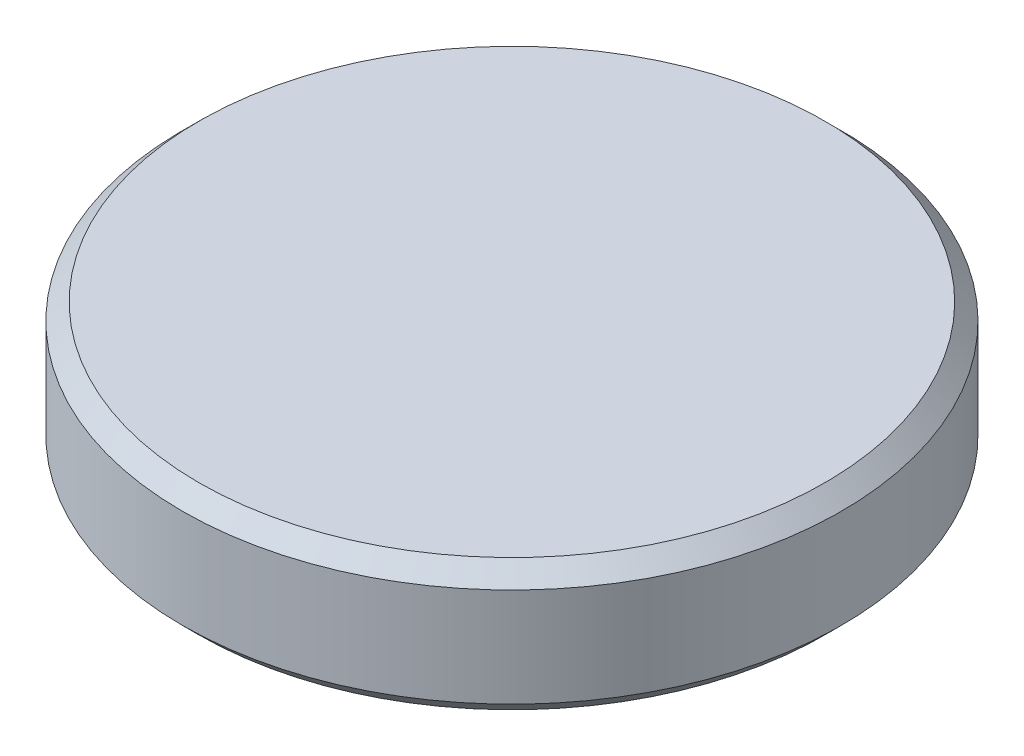
ISO-10303-21;
HEADER;
FILE_DESCRIPTION(('STEP AP214'),'2;1');
FILE_NAME('part.step','',(''),(''),'','','');
FILE_SCHEMA(('AUTOMOTIVE_DESIGN { 1 0 10303 214 1 1 1 1 }'));
ENDSEC;
DATA;
#1=APPLICATION_CONTEXT('core data for automotive mechanical design processes');
#2=APPLICATION_PROTOCOL_DEFINITION('international standard','automotive_design',2000,#1);
#3=PRODUCT_CONTEXT('',#1,'mechanical');
#4=PRODUCT('Part','Part','',(#3));
#5=PRODUCT_RELATED_PRODUCT_CATEGORY('part','',(#4));
#6=PRODUCT_DEFINITION_FORMATION('','',#4);
#7=PRODUCT_DEFINITION_CONTEXT('part definition',#1,'design');
#8=PRODUCT_DEFINITION('design','',#6,#7);
#9=PRODUCT_DEFINITION_SHAPE('','',#8);
#10=(LENGTH_UNIT() NAMED_UNIT(*) SI_UNIT(.MILLI.,.METRE.));
#11=(NAMED_UNIT(*) PLANE_ANGLE_UNIT() SI_UNIT($,.RADIAN.));
#12=(NAMED_UNIT(*) SI_UNIT($,.STERADIAN.) SOLID_ANGLE_UNIT());
#13=UNCERTAINTY_MEASURE_WITH_UNIT(LENGTH_MEASURE(1.E-05),#10,'distance_accuracy_value','');
#14=(GEOMETRIC_REPRESENTATION_CONTEXT(3) GLOBAL_UNCERTAINTY_ASSIGNED_CONTEXT((#13)) GLOBAL_UNIT_ASSIGNED_CONTEXT((#10,
#11,#12)) REPRESENTATION_CONTEXT('',''));
#15=CARTESIAN_POINT('',(0.,0.,0.));
#16=DIRECTION('',(0.,0.,1.));
#17=DIRECTION('',(1.,0.,0.));
#18=AXIS2_PLACEMENT_3D('',#15,#16,#17);
#19=CARTESIAN_POINT('',(0.,2.,0.));
#20=DIRECTION('',(0.,-1.,0.));
#21=DIRECTION('',(0.,0.,-1.));
#22=AXIS2_PLACEMENT_3D('',#19,#20,#21);
#23=CYLINDRICAL_SURFACE('',#22,5.);
#24=CARTESIAN_POINT('',(0.,0.250000000000002,0.));
#25=DIRECTION('',(0.,1.,0.));
#26=DIRECTION('',(0.,0.,1.));
#27=AXIS2_PLACEMENT_3D('',#24,#25,#26);
#28=CIRCLE('',#27,5.);
#29=CARTESIAN_POINT('',(0.,0.250000000000002,5.));
#30=VERTEX_POINT('',#29);
#31=EDGE_CURVE('E42',#30,#30,#28,.T.);
#32=ORIENTED_EDGE('',*,*,#31,.T.);
#33=EDGE_LOOP('',(#32));
#34=FACE_BOUND('',#33,.T.);
#35=CARTESIAN_POINT('',(0.,1.75,0.));
#36=DIRECTION('',(0.,1.,0.));
#37=DIRECTION('',(0.,0.,1.));
#38=AXIS2_PLACEMENT_3D('',#35,#36,#37);
#39=CIRCLE('',#38,5.);
#40=CARTESIAN_POINT('',(0.,1.75,5.));
#41=VERTEX_POINT('',#40);
#42=EDGE_CURVE('E46',#41,#41,#39,.F.);
#43=ORIENTED_EDGE('',*,*,#42,.T.);
#44=EDGE_LOOP('',(#43));
#45=FACE_BOUND('',#44,.T.);
#46=ADVANCED_FACE('F31',(#34,#45),#23,.T.);
#47=CARTESIAN_POINT('',(0.,2.,0.));
#48=DIRECTION('',(0.,1.,0.));
#49=DIRECTION('',(0.,0.,1.));
#50=AXIS2_PLACEMENT_3D('',#47,#48,#49);
#51=PLANE('',#50);
#52=CARTESIAN_POINT('',(0.,2.,0.));
#53=DIRECTION('',(0.,1.,0.));
#54=DIRECTION('',(0.,0.,1.));
#55=AXIS2_PLACEMENT_3D('',#52,#53,#54);
#56=CIRCLE('',#55,4.75);
#57=CARTESIAN_POINT('',(0.,2.,4.75));
#58=VERTEX_POINT('',#57);
#59=EDGE_CURVE('E10',#58,#58,#56,.T.);
#60=ORIENTED_EDGE('',*,*,#59,.T.);
#61=EDGE_LOOP('',(#60));
#62=FACE_BOUND('',#61,.T.);
#63=ADVANCED_FACE('F62',(#62),#51,.T.);
#64=CARTESIAN_POINT('',(0.,0.,0.));
#65=DIRECTION('',(0.,1.,0.));
#66=DIRECTION('',(0.,0.,1.));
#67=AXIS2_PLACEMENT_3D('',#64,#65,#66);
#68=PLANE('',#67);
#69=CARTESIAN_POINT('',(0.,0.,0.));
#70=DIRECTION('',(0.,1.,0.));
#71=DIRECTION('',(0.,0.,1.));
#72=AXIS2_PLACEMENT_3D('',#69,#70,#71);
#73=CIRCLE('',#72,4.75);
#74=CARTESIAN_POINT('',(0.,0.,4.75));
#75=VERTEX_POINT('',#74);
#76=EDGE_CURVE('E38',#75,#75,#73,.F.);
#77=ORIENTED_EDGE('',*,*,#76,.T.);
#78=EDGE_LOOP('',(#77));
#79=FACE_BOUND('',#78,.T.);
#80=ADVANCED_FACE('F59',(#79),#68,.F.);
#81=CARTESIAN_POINT('',(0.,0.250000000000002,0.));
#82=DIRECTION('',(0.,1.,0.));
#83=DIRECTION('',(0.,0.,1.));
#84=AXIS2_PLACEMENT_3D('',#81,#82,#83);
#85=CONICAL_SURFACE('',#84,5.,0.785398163397452);
#86=ORIENTED_EDGE('',*,*,#76,.F.);
#87=EDGE_LOOP('',(#86));
#88=FACE_BOUND('',#87,.T.);
#89=ORIENTED_EDGE('',*,*,#31,.F.);
#90=EDGE_LOOP('',(#89));
#91=FACE_BOUND('',#90,.T.);
#92=ADVANCED_FACE('F55',(#88,#91),#85,.T.);
#93=CARTESIAN_POINT('',(0.,2.,0.));
#94=DIRECTION('',(0.,-1.,0.));
#95=DIRECTION('',(0.,0.,-1.));
#96=AXIS2_PLACEMENT_3D('',#93,#94,#95);
#97=CONICAL_SURFACE('',#96,4.75,0.785398163397448);
#98=ORIENTED_EDGE('',*,*,#42,.F.);
#99=EDGE_LOOP('',(#98));
#100=FACE_BOUND('',#99,.T.);
#101=ORIENTED_EDGE('',*,*,#59,.F.);
#102=EDGE_LOOP('',(#101));
#103=FACE_BOUND('',#102,.T.);
#104=ADVANCED_FACE('F33',(#100,#103),#97,.T.);
#105=CLOSED_SHELL('',(#46,#63,#80,#92,#104));
#106=MANIFOLD_SOLID_BREP('B2',#105);
#107=ADVANCED_BREP_SHAPE_REPRESENTATION('',(#18,#106),#14);
#108=SHAPE_DEFINITION_REPRESENTATION(#9,#107);
ENDSEC;
END-ISO-10303-21;
